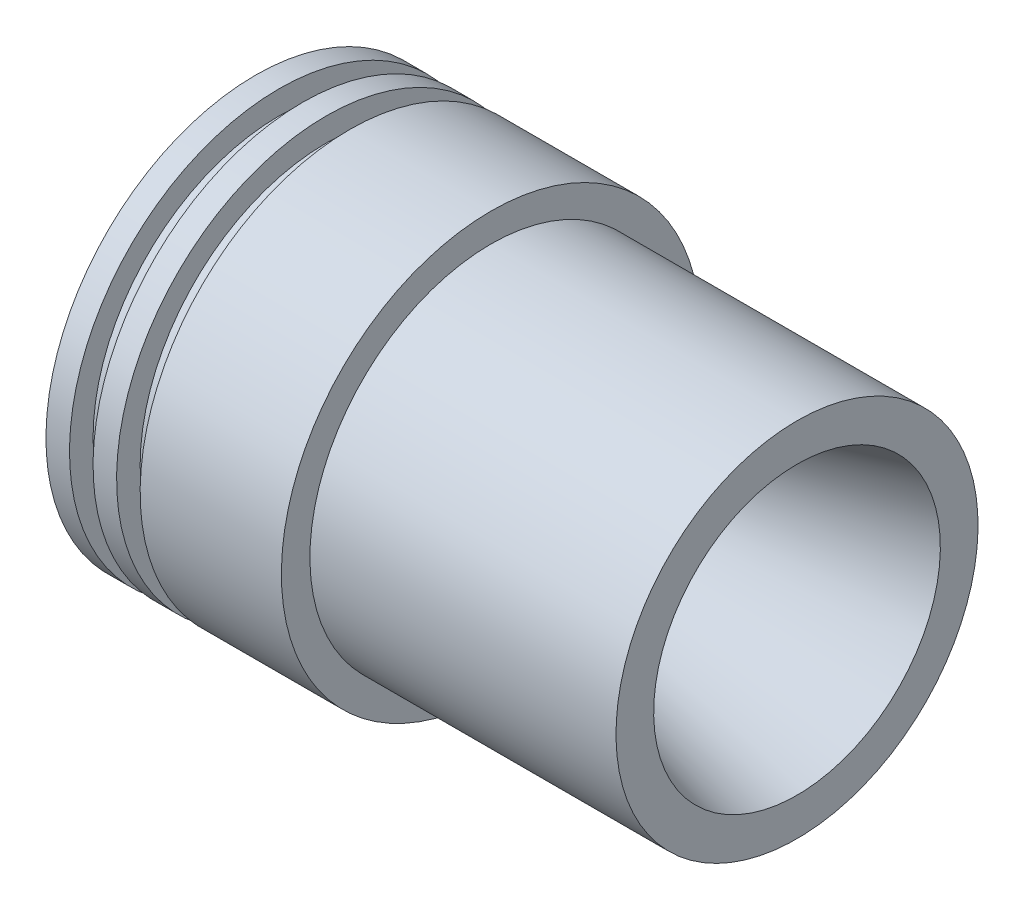
ISO-10303-21;
HEADER;
FILE_DESCRIPTION(('STEP AP214'),'2;1');
FILE_NAME('part.step','',(''),(''),'','','');
FILE_SCHEMA(('AUTOMOTIVE_DESIGN { 1 0 10303 214 1 1 1 1 }'));
ENDSEC;
DATA;
#1=APPLICATION_CONTEXT('core data for automotive mechanical design processes');
#2=APPLICATION_PROTOCOL_DEFINITION('international standard','automotive_design',2000,#1);
#3=PRODUCT_CONTEXT('',#1,'mechanical');
#4=PRODUCT('Part','Part','',(#3));
#5=PRODUCT_RELATED_PRODUCT_CATEGORY('part','',(#4));
#6=PRODUCT_DEFINITION_FORMATION('','',#4);
#7=PRODUCT_DEFINITION_CONTEXT('part definition',#1,'design');
#8=PRODUCT_DEFINITION('design','',#6,#7);
#9=PRODUCT_DEFINITION_SHAPE('','',#8);
#10=(LENGTH_UNIT() NAMED_UNIT(*) SI_UNIT(.MILLI.,.METRE.));
#11=(NAMED_UNIT(*) PLANE_ANGLE_UNIT() SI_UNIT($,.RADIAN.));
#12=(NAMED_UNIT(*) SI_UNIT($,.STERADIAN.) SOLID_ANGLE_UNIT());
#13=UNCERTAINTY_MEASURE_WITH_UNIT(LENGTH_MEASURE(1.E-05),#10,'distance_accuracy_value','');
#14=(GEOMETRIC_REPRESENTATION_CONTEXT(3) GLOBAL_UNCERTAINTY_ASSIGNED_CONTEXT((#13)) GLOBAL_UNIT_ASSIGNED_CONTEXT((#10,
#11,#12)) REPRESENTATION_CONTEXT('',''));
#15=CARTESIAN_POINT('',(0.,0.,0.));
#16=DIRECTION('',(0.,0.,1.));
#17=DIRECTION('',(1.,0.,0.));
#18=AXIS2_PLACEMENT_3D('',#15,#16,#17);
#19=CARTESIAN_POINT('',(-115.,36.5,0.));
#20=DIRECTION('',(-1.,0.,0.));
#21=DIRECTION('',(0.,-1.,0.));
#22=AXIS2_PLACEMENT_3D('',#19,#20,#21);
#23=PLANE('',#22);
#24=CARTESIAN_POINT('',(-115.,0.,0.));
#25=DIRECTION('',(1.,0.,0.));
#26=DIRECTION('',(0.,1.,0.));
#27=AXIS2_PLACEMENT_3D('',#24,#25,#26);
#28=CIRCLE('',#27,36.5);
#29=CARTESIAN_POINT('',(-115.,36.5,0.));
#30=VERTEX_POINT('',#29);
#31=EDGE_CURVE('E89',#30,#30,#28,.T.);
#32=ORIENTED_EDGE('',*,*,#31,.T.);
#33=EDGE_LOOP('',(#32));
#34=FACE_BOUND('',#33,.T.);
#35=CARTESIAN_POINT('',(-115.,0.,0.));
#36=DIRECTION('',(1.,0.,0.));
#37=DIRECTION('',(0.,1.,0.));
#38=AXIS2_PLACEMENT_3D('',#35,#36,#37);
#39=CIRCLE('',#38,44.5);
#40=CARTESIAN_POINT('',(-115.,44.5,0.));
#41=VERTEX_POINT('',#40);
#42=EDGE_CURVE('E10',#41,#41,#39,.T.);
#43=ORIENTED_EDGE('',*,*,#42,.F.);
#44=EDGE_LOOP('',(#43));
#45=FACE_BOUND('',#44,.T.);
#46=ADVANCED_FACE('F37',(#34,#45),#23,.T.);
#47=CARTESIAN_POINT('',(0.,0.,0.));
#48=DIRECTION('',(1.,0.,0.));
#49=DIRECTION('',(0.,1.,0.));
#50=AXIS2_PLACEMENT_3D('',#47,#48,#49);
#51=CYLINDRICAL_SURFACE('',#50,44.5);
#52=ORIENTED_EDGE('',*,*,#42,.T.);
#53=EDGE_LOOP('',(#52));
#54=FACE_BOUND('',#53,.T.);
#55=CARTESIAN_POINT('',(-110.,0.,0.));
#56=DIRECTION('',(1.,0.,0.));
#57=DIRECTION('',(0.,1.,0.));
#58=AXIS2_PLACEMENT_3D('',#55,#56,#57);
#59=CIRCLE('',#58,44.5);
#60=CARTESIAN_POINT('',(-110.,44.5,0.));
#61=VERTEX_POINT('',#60);
#62=EDGE_CURVE('E43',#61,#61,#59,.T.);
#63=ORIENTED_EDGE('',*,*,#62,.F.);
#64=EDGE_LOOP('',(#63));
#65=FACE_BOUND('',#64,.T.);
#66=ADVANCED_FACE('F107',(#54,#65),#51,.T.);
#67=CARTESIAN_POINT('',(-110.,44.5,0.));
#68=DIRECTION('',(1.,0.,0.));
#69=DIRECTION('',(0.,1.,0.));
#70=AXIS2_PLACEMENT_3D('',#67,#68,#69);
#71=PLANE('',#70);
#72=ORIENTED_EDGE('',*,*,#62,.T.);
#73=EDGE_LOOP('',(#72));
#74=FACE_BOUND('',#73,.T.);
#75=CARTESIAN_POINT('',(-110.,0.,0.));
#76=DIRECTION('',(1.,0.,0.));
#77=DIRECTION('',(0.,1.,0.));
#78=AXIS2_PLACEMENT_3D('',#75,#76,#77);
#79=CIRCLE('',#78,39.5);
#80=CARTESIAN_POINT('',(-110.,39.5,0.));
#81=VERTEX_POINT('',#80);
#82=EDGE_CURVE('E47',#81,#81,#79,.T.);
#83=ORIENTED_EDGE('',*,*,#82,.F.);
#84=EDGE_LOOP('',(#83));
#85=FACE_BOUND('',#84,.T.);
#86=ADVANCED_FACE('F111',(#74,#85),#71,.T.);
#87=CARTESIAN_POINT('',(0.,0.,0.));
#88=DIRECTION('',(1.,0.,0.));
#89=DIRECTION('',(0.,1.,0.));
#90=AXIS2_PLACEMENT_3D('',#87,#88,#89);
#91=CYLINDRICAL_SURFACE('',#90,39.5);
#92=ORIENTED_EDGE('',*,*,#82,.T.);
#93=EDGE_LOOP('',(#92));
#94=FACE_BOUND('',#93,.T.);
#95=CARTESIAN_POINT('',(-105.,0.,0.));
#96=DIRECTION('',(1.,0.,0.));
#97=DIRECTION('',(0.,1.,0.));
#98=AXIS2_PLACEMENT_3D('',#95,#96,#97);
#99=CIRCLE('',#98,39.5);
#100=CARTESIAN_POINT('',(-105.,39.5,0.));
#101=VERTEX_POINT('',#100);
#102=EDGE_CURVE('E51',#101,#101,#99,.T.);
#103=ORIENTED_EDGE('',*,*,#102,.F.);
#104=EDGE_LOOP('',(#103));
#105=FACE_BOUND('',#104,.T.);
#106=ADVANCED_FACE('F115',(#94,#105),#91,.T.);
#107=CARTESIAN_POINT('',(-105.,39.5,0.));
#108=DIRECTION('',(-1.,0.,0.));
#109=DIRECTION('',(0.,-1.,0.));
#110=AXIS2_PLACEMENT_3D('',#107,#108,#109);
#111=PLANE('',#110);
#112=ORIENTED_EDGE('',*,*,#102,.T.);
#113=EDGE_LOOP('',(#112));
#114=FACE_BOUND('',#113,.T.);
#115=CARTESIAN_POINT('',(-105.,0.,0.));
#116=DIRECTION('',(1.,0.,0.));
#117=DIRECTION('',(0.,1.,0.));
#118=AXIS2_PLACEMENT_3D('',#115,#116,#117);
#119=CIRCLE('',#118,44.5);
#120=CARTESIAN_POINT('',(-105.,44.5,0.));
#121=VERTEX_POINT('',#120);
#122=EDGE_CURVE('E56',#121,#121,#119,.T.);
#123=ORIENTED_EDGE('',*,*,#122,.F.);
#124=EDGE_LOOP('',(#123));
#125=FACE_BOUND('',#124,.T.);
#126=ADVANCED_FACE('F121',(#114,#125),#111,.T.);
#127=CARTESIAN_POINT('',(0.,0.,0.));
#128=DIRECTION('',(1.,0.,0.));
#129=DIRECTION('',(0.,1.,0.));
#130=AXIS2_PLACEMENT_3D('',#127,#128,#129);
#131=CYLINDRICAL_SURFACE('',#130,44.5);
#132=ORIENTED_EDGE('',*,*,#122,.T.);
#133=EDGE_LOOP('',(#132));
#134=FACE_BOUND('',#133,.T.);
#135=CARTESIAN_POINT('',(-100.,0.,0.));
#136=DIRECTION('',(1.,0.,0.));
#137=DIRECTION('',(0.,1.,0.));
#138=AXIS2_PLACEMENT_3D('',#135,#136,#137);
#139=CIRCLE('',#138,44.5);
#140=CARTESIAN_POINT('',(-100.,44.5,0.));
#141=VERTEX_POINT('',#140);
#142=EDGE_CURVE('E59',#141,#141,#139,.T.);
#143=ORIENTED_EDGE('',*,*,#142,.F.);
#144=EDGE_LOOP('',(#143));
#145=FACE_BOUND('',#144,.T.);
#146=ADVANCED_FACE('F125',(#134,#145),#131,.T.);
#147=CARTESIAN_POINT('',(-100.,44.5,0.));
#148=DIRECTION('',(1.,0.,0.));
#149=DIRECTION('',(0.,1.,0.));
#150=AXIS2_PLACEMENT_3D('',#147,#148,#149);
#151=PLANE('',#150);
#152=ORIENTED_EDGE('',*,*,#142,.T.);
#153=EDGE_LOOP('',(#152));
#154=FACE_BOUND('',#153,.T.);
#155=CARTESIAN_POINT('',(-100.,0.,0.));
#156=DIRECTION('',(1.,0.,0.));
#157=DIRECTION('',(0.,1.,0.));
#158=AXIS2_PLACEMENT_3D('',#155,#156,#157);
#159=CIRCLE('',#158,39.5);
#160=CARTESIAN_POINT('',(-100.,39.5,0.));
#161=VERTEX_POINT('',#160);
#162=EDGE_CURVE('E62',#161,#161,#159,.T.);
#163=ORIENTED_EDGE('',*,*,#162,.F.);
#164=EDGE_LOOP('',(#163));
#165=FACE_BOUND('',#164,.T.);
#166=ADVANCED_FACE('F129',(#154,#165),#151,.T.);
#167=CARTESIAN_POINT('',(0.,0.,0.));
#168=DIRECTION('',(1.,0.,0.));
#169=DIRECTION('',(0.,1.,0.));
#170=AXIS2_PLACEMENT_3D('',#167,#168,#169);
#171=CYLINDRICAL_SURFACE('',#170,39.5);
#172=ORIENTED_EDGE('',*,*,#162,.T.);
#173=EDGE_LOOP('',(#172));
#174=FACE_BOUND('',#173,.T.);
#175=CARTESIAN_POINT('',(-95.,0.,0.));
#176=DIRECTION('',(1.,0.,0.));
#177=DIRECTION('',(0.,1.,0.));
#178=AXIS2_PLACEMENT_3D('',#175,#176,#177);
#179=CIRCLE('',#178,39.5);
#180=CARTESIAN_POINT('',(-95.,39.5,0.));
#181=VERTEX_POINT('',#180);
#182=EDGE_CURVE('E65',#181,#181,#179,.T.);
#183=ORIENTED_EDGE('',*,*,#182,.F.);
#184=EDGE_LOOP('',(#183));
#185=FACE_BOUND('',#184,.T.);
#186=ADVANCED_FACE('F133',(#174,#185),#171,.T.);
#187=CARTESIAN_POINT('',(-95.,39.5,0.));
#188=DIRECTION('',(-1.,0.,0.));
#189=DIRECTION('',(0.,-1.,0.));
#190=AXIS2_PLACEMENT_3D('',#187,#188,#189);
#191=PLANE('',#190);
#192=ORIENTED_EDGE('',*,*,#182,.T.);
#193=EDGE_LOOP('',(#192));
#194=FACE_BOUND('',#193,.T.);
#195=CARTESIAN_POINT('',(-95.,0.,0.));
#196=DIRECTION('',(1.,0.,0.));
#197=DIRECTION('',(0.,1.,0.));
#198=AXIS2_PLACEMENT_3D('',#195,#196,#197);
#199=CIRCLE('',#198,44.5);
#200=CARTESIAN_POINT('',(-95.,44.5,0.));
#201=VERTEX_POINT('',#200);
#202=EDGE_CURVE('E68',#201,#201,#199,.T.);
#203=ORIENTED_EDGE('',*,*,#202,.F.);
#204=EDGE_LOOP('',(#203));
#205=FACE_BOUND('',#204,.T.);
#206=ADVANCED_FACE('F137',(#194,#205),#191,.T.);
#207=CARTESIAN_POINT('',(0.,0.,0.));
#208=DIRECTION('',(1.,0.,0.));
#209=DIRECTION('',(0.,1.,0.));
#210=AXIS2_PLACEMENT_3D('',#207,#208,#209);
#211=CYLINDRICAL_SURFACE('',#210,44.5);
#212=ORIENTED_EDGE('',*,*,#202,.T.);
#213=EDGE_LOOP('',(#212));
#214=FACE_BOUND('',#213,.T.);
#215=CARTESIAN_POINT('',(-65.,0.,0.));
#216=DIRECTION('',(1.,0.,0.));
#217=DIRECTION('',(0.,1.,0.));
#218=AXIS2_PLACEMENT_3D('',#215,#216,#217);
#219=CIRCLE('',#218,44.5);
#220=CARTESIAN_POINT('',(-65.,44.5,0.));
#221=VERTEX_POINT('',#220);
#222=EDGE_CURVE('E71',#221,#221,#219,.T.);
#223=ORIENTED_EDGE('',*,*,#222,.F.);
#224=EDGE_LOOP('',(#223));
#225=FACE_BOUND('',#224,.T.);
#226=ADVANCED_FACE('F141',(#214,#225),#211,.T.);
#227=CARTESIAN_POINT('',(-65.,38.4436675587035,0.));
#228=DIRECTION('',(1.,0.,0.));
#229=DIRECTION('',(0.,1.,0.));
#230=AXIS2_PLACEMENT_3D('',#227,#228,#229);
#231=PLANE('',#230);
#232=ORIENTED_EDGE('',*,*,#222,.T.);
#233=EDGE_LOOP('',(#232));
#234=FACE_BOUND('',#233,.T.);
#235=CARTESIAN_POINT('',(-65.,0.,0.));
#236=DIRECTION('',(1.,0.,0.));
#237=DIRECTION('',(0.,1.,0.));
#238=AXIS2_PLACEMENT_3D('',#235,#236,#237);
#239=CIRCLE('',#238,38.4436675587035);
#240=CARTESIAN_POINT('',(-65.,38.4436675587035,0.));
#241=VERTEX_POINT('',#240);
#242=EDGE_CURVE('E74',#241,#241,#239,.T.);
#243=ORIENTED_EDGE('',*,*,#242,.F.);
#244=EDGE_LOOP('',(#243));
#245=FACE_BOUND('',#244,.T.);
#246=ADVANCED_FACE('F145',(#234,#245),#231,.T.);
#247=CARTESIAN_POINT('',(0.,0.,0.));
#248=DIRECTION('',(1.,0.,0.));
#249=DIRECTION('',(0.,1.,0.));
#250=AXIS2_PLACEMENT_3D('',#247,#248,#249);
#251=CYLINDRICAL_SURFACE('',#250,38.4436675587035);
#252=ORIENTED_EDGE('',*,*,#242,.T.);
#253=EDGE_LOOP('',(#252));
#254=FACE_BOUND('',#253,.T.);
#255=CARTESIAN_POINT('',(0.,0.,0.));
#256=DIRECTION('',(1.,0.,0.));
#257=DIRECTION('',(0.,1.,0.));
#258=AXIS2_PLACEMENT_3D('',#255,#256,#257);
#259=CIRCLE('',#258,38.4436675587035);
#260=CARTESIAN_POINT('',(0.,38.4436675587035,0.));
#261=VERTEX_POINT('',#260);
#262=EDGE_CURVE('E77',#261,#261,#259,.T.);
#263=ORIENTED_EDGE('',*,*,#262,.F.);
#264=EDGE_LOOP('',(#263));
#265=FACE_BOUND('',#264,.T.);
#266=ADVANCED_FACE('F149',(#254,#265),#251,.T.);
#267=CARTESIAN_POINT('',(0.,30.4436675587035,0.));
#268=DIRECTION('',(1.,0.,0.));
#269=DIRECTION('',(0.,1.,0.));
#270=AXIS2_PLACEMENT_3D('',#267,#268,#269);
#271=PLANE('',#270);
#272=ORIENTED_EDGE('',*,*,#262,.T.);
#273=EDGE_LOOP('',(#272));
#274=FACE_BOUND('',#273,.T.);
#275=CARTESIAN_POINT('',(0.,0.,0.));
#276=DIRECTION('',(1.,0.,0.));
#277=DIRECTION('',(0.,1.,0.));
#278=AXIS2_PLACEMENT_3D('',#275,#276,#277);
#279=CIRCLE('',#278,30.4436675587035);
#280=CARTESIAN_POINT('',(0.,30.4436675587035,0.));
#281=VERTEX_POINT('',#280);
#282=EDGE_CURVE('E80',#281,#281,#279,.T.);
#283=ORIENTED_EDGE('',*,*,#282,.F.);
#284=EDGE_LOOP('',(#283));
#285=FACE_BOUND('',#284,.T.);
#286=ADVANCED_FACE('F153',(#274,#285),#271,.T.);
#287=CARTESIAN_POINT('',(-70.6987298107775,0.,0.));
#288=DIRECTION('',(1.,0.,0.));
#289=DIRECTION('',(0.,1.,0.));
#290=AXIS2_PLACEMENT_3D('',#287,#288,#289);
#291=CONICAL_SURFACE('',#290,11.5,0.261799387799143);
#292=ORIENTED_EDGE('',*,*,#282,.T.);
#293=EDGE_LOOP('',(#292));
#294=FACE_BOUND('',#293,.T.);
#295=CARTESIAN_POINT('',(-70.6987298107775,0.,0.));
#296=DIRECTION('',(1.,0.,0.));
#297=DIRECTION('',(0.,1.,0.));
#298=AXIS2_PLACEMENT_3D('',#295,#296,#297);
#299=CIRCLE('',#298,11.5);
#300=CARTESIAN_POINT('',(-70.6987298107775,11.5,0.));
#301=VERTEX_POINT('',#300);
#302=EDGE_CURVE('E83',#301,#301,#299,.T.);
#303=ORIENTED_EDGE('',*,*,#302,.F.);
#304=EDGE_LOOP('',(#303));
#305=FACE_BOUND('',#304,.T.);
#306=ADVANCED_FACE('F103',(#294,#305),#291,.F.);
#307=CARTESIAN_POINT('',(0.,0.,0.));
#308=DIRECTION('',(1.,0.,0.));
#309=DIRECTION('',(0.,1.,0.));
#310=AXIS2_PLACEMENT_3D('',#307,#308,#309);
#311=CYLINDRICAL_SURFACE('',#310,11.5);
#312=ORIENTED_EDGE('',*,*,#302,.T.);
#313=EDGE_LOOP('',(#312));
#314=FACE_BOUND('',#313,.T.);
#315=CARTESIAN_POINT('',(-71.6987298107775,0.,0.));
#316=DIRECTION('',(1.,0.,0.));
#317=DIRECTION('',(0.,1.,0.));
#318=AXIS2_PLACEMENT_3D('',#315,#316,#317);
#319=CIRCLE('',#318,11.5);
#320=CARTESIAN_POINT('',(-71.6987298107775,11.5,0.));
#321=VERTEX_POINT('',#320);
#322=EDGE_CURVE('E86',#321,#321,#319,.T.);
#323=ORIENTED_EDGE('',*,*,#322,.F.);
#324=EDGE_LOOP('',(#323));
#325=FACE_BOUND('',#324,.T.);
#326=ADVANCED_FACE('F97',(#314,#325),#311,.F.);
#327=CARTESIAN_POINT('',(-115.,0.,0.));
#328=DIRECTION('',(-1.,0.,0.));
#329=DIRECTION('',(0.,-1.,0.));
#330=AXIS2_PLACEMENT_3D('',#327,#328,#329);
#331=CONICAL_SURFACE('',#330,36.5,0.523598775598293);
#332=ORIENTED_EDGE('',*,*,#322,.T.);
#333=EDGE_LOOP('',(#332));
#334=FACE_BOUND('',#333,.T.);
#335=ORIENTED_EDGE('',*,*,#31,.F.);
#336=EDGE_LOOP('',(#335));
#337=FACE_BOUND('',#336,.T.);
#338=ADVANCED_FACE('F95',(#334,#337),#331,.F.);
#339=CLOSED_SHELL('',(#46,#66,#86,#106,#126,#146,#166,#186,#206,#226,#246,#266,#286,#306,#326,#338));
#340=MANIFOLD_SOLID_BREP('B2',#339);
#341=ADVANCED_BREP_SHAPE_REPRESENTATION('',(#18,#340),#14);
#342=SHAPE_DEFINITION_REPRESENTATION(#9,#341);
ENDSEC;
END-ISO-10303-21;
